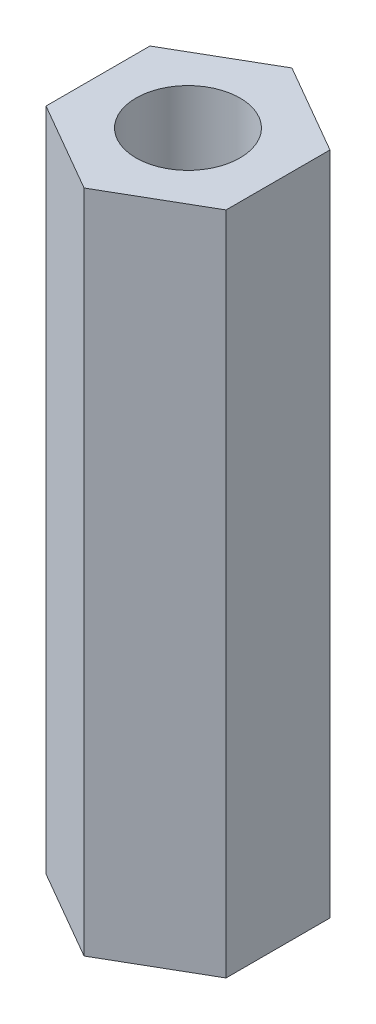
ISO-10303-21;
HEADER;
FILE_DESCRIPTION(('STEP AP214'),'2;1');
FILE_NAME('part.step','',(''),(''),'','','');
FILE_SCHEMA(('AUTOMOTIVE_DESIGN { 1 0 10303 214 1 1 1 1 }'));
ENDSEC;
DATA;
#1=APPLICATION_CONTEXT('core data for automotive mechanical design processes');
#2=APPLICATION_PROTOCOL_DEFINITION('international standard','automotive_design',2000,#1);
#3=PRODUCT_CONTEXT('',#1,'mechanical');
#4=PRODUCT('Part','Part','',(#3));
#5=PRODUCT_RELATED_PRODUCT_CATEGORY('part','',(#4));
#6=PRODUCT_DEFINITION_FORMATION('','',#4);
#7=PRODUCT_DEFINITION_CONTEXT('part definition',#1,'design');
#8=PRODUCT_DEFINITION('design','',#6,#7);
#9=PRODUCT_DEFINITION_SHAPE('','',#8);
#10=(LENGTH_UNIT() NAMED_UNIT(*) SI_UNIT(.MILLI.,.METRE.));
#11=(NAMED_UNIT(*) PLANE_ANGLE_UNIT() SI_UNIT($,.RADIAN.));
#12=(NAMED_UNIT(*) SI_UNIT($,.STERADIAN.) SOLID_ANGLE_UNIT());
#13=UNCERTAINTY_MEASURE_WITH_UNIT(LENGTH_MEASURE(1.E-05),#10,'distance_accuracy_value','');
#14=(GEOMETRIC_REPRESENTATION_CONTEXT(3) GLOBAL_UNCERTAINTY_ASSIGNED_CONTEXT((#13)) GLOBAL_UNIT_ASSIGNED_CONTEXT((#10,
#11,#12)) REPRESENTATION_CONTEXT('',''));
#15=CARTESIAN_POINT('',(0.,0.,0.));
#16=DIRECTION('',(0.,0.,1.));
#17=DIRECTION('',(1.,0.,0.));
#18=AXIS2_PLACEMENT_3D('',#15,#16,#17);
#19=CARTESIAN_POINT('',(0.,32.,-5.));
#20=DIRECTION('',(0.,1.,0.));
#21=DIRECTION('',(0.,0.,1.));
#22=AXIS2_PLACEMENT_3D('',#19,#20,#21);
#23=PLANE('',#22);
#24=DIRECTION('',(-0.866025403784439,0.,-0.5));
#25=VECTOR('',#24,1.);
#26=CARTESIAN_POINT('',(4.33012701892219,32.,-2.5));
#27=LINE('',#26,#25);
#28=CARTESIAN_POINT('',(4.33012701892219,32.,-2.5));
#29=VERTEX_POINT('',#28);
#30=CARTESIAN_POINT('',(0.,32.,-5.));
#31=VERTEX_POINT('',#30);
#32=EDGE_CURVE('E126',#29,#31,#27,.T.);
#33=ORIENTED_EDGE('',*,*,#32,.T.);
#34=DIRECTION('',(-0.866025403784439,0.,0.5));
#35=VECTOR('',#34,1.);
#36=CARTESIAN_POINT('',(0.,32.,-5.));
#37=LINE('',#36,#35);
#38=CARTESIAN_POINT('',(-4.33012701892219,32.,-2.5));
#39=VERTEX_POINT('',#38);
#40=EDGE_CURVE('E84',#31,#39,#37,.T.);
#41=ORIENTED_EDGE('',*,*,#40,.T.);
#42=DIRECTION('',(0.,0.,1.));
#43=VECTOR('',#42,1.);
#44=CARTESIAN_POINT('',(-4.33012701892219,32.,-2.5));
#45=LINE('',#44,#43);
#46=CARTESIAN_POINT('',(-4.33012701892219,32.,2.5));
#47=VERTEX_POINT('',#46);
#48=EDGE_CURVE('E97',#39,#47,#45,.T.);
#49=ORIENTED_EDGE('',*,*,#48,.T.);
#50=DIRECTION('',(0.866025403784439,0.,0.5));
#51=VECTOR('',#50,1.);
#52=CARTESIAN_POINT('',(-4.33012701892219,32.,2.5));
#53=LINE('',#52,#51);
#54=CARTESIAN_POINT('',(0.,32.,5.));
#55=VERTEX_POINT('',#54);
#56=EDGE_CURVE('E91',#47,#55,#53,.T.);
#57=ORIENTED_EDGE('',*,*,#56,.T.);
#58=DIRECTION('',(0.866025403784439,0.,-0.5));
#59=VECTOR('',#58,1.);
#60=CARTESIAN_POINT('',(0.,32.,5.));
#61=LINE('',#60,#59);
#62=CARTESIAN_POINT('',(4.33012701892219,32.,2.5));
#63=VERTEX_POINT('',#62);
#64=EDGE_CURVE('E95',#55,#63,#61,.T.);
#65=ORIENTED_EDGE('',*,*,#64,.T.);
#66=DIRECTION('',(0.,0.,-1.));
#67=VECTOR('',#66,1.);
#68=CARTESIAN_POINT('',(4.33012701892219,32.,2.5));
#69=LINE('',#68,#67);
#70=EDGE_CURVE('E47',#63,#29,#69,.T.);
#71=ORIENTED_EDGE('',*,*,#70,.T.);
#72=EDGE_LOOP('',(#33,#41,#49,#57,#65,#71));
#73=FACE_BOUND('',#72,.T.);
#74=CARTESIAN_POINT('',(0.,32.,0.));
#75=DIRECTION('',(0.,1.,0.));
#76=DIRECTION('',(0.,0.,1.));
#77=AXIS2_PLACEMENT_3D('',#74,#75,#76);
#78=CIRCLE('',#77,2.5);
#79=CARTESIAN_POINT('',(0.,32.,2.5));
#80=VERTEX_POINT('',#79);
#81=EDGE_CURVE('E119',#80,#80,#78,.T.);
#82=ORIENTED_EDGE('',*,*,#81,.F.);
#83=EDGE_LOOP('',(#82));
#84=FACE_BOUND('',#83,.T.);
#85=ADVANCED_FACE('F30',(#73,#84),#23,.T.);
#86=CARTESIAN_POINT('',(0.,0.,-5.));
#87=DIRECTION('',(0.,1.,0.));
#88=DIRECTION('',(0.,0.,1.));
#89=AXIS2_PLACEMENT_3D('',#86,#87,#88);
#90=PLANE('',#89);
#91=DIRECTION('',(-0.866025403784439,0.,-0.5));
#92=VECTOR('',#91,1.);
#93=CARTESIAN_POINT('',(4.33012701892219,0.,-2.5));
#94=LINE('',#93,#92);
#95=CARTESIAN_POINT('',(4.33012701892219,0.,-2.5));
#96=VERTEX_POINT('',#95);
#97=CARTESIAN_POINT('',(0.,0.,-5.));
#98=VERTEX_POINT('',#97);
#99=EDGE_CURVE('E115',#96,#98,#94,.T.);
#100=ORIENTED_EDGE('',*,*,#99,.F.);
#101=DIRECTION('',(0.,0.,-1.));
#102=VECTOR('',#101,1.);
#103=CARTESIAN_POINT('',(4.33012701892219,0.,2.5));
#104=LINE('',#103,#102);
#105=CARTESIAN_POINT('',(4.33012701892219,0.,2.5));
#106=VERTEX_POINT('',#105);
#107=EDGE_CURVE('E76',#106,#96,#104,.T.);
#108=ORIENTED_EDGE('',*,*,#107,.F.);
#109=DIRECTION('',(0.866025403784439,0.,-0.5));
#110=VECTOR('',#109,1.);
#111=CARTESIAN_POINT('',(0.,0.,5.));
#112=LINE('',#111,#110);
#113=CARTESIAN_POINT('',(0.,0.,5.));
#114=VERTEX_POINT('',#113);
#115=EDGE_CURVE('E70',#114,#106,#112,.T.);
#116=ORIENTED_EDGE('',*,*,#115,.F.);
#117=DIRECTION('',(0.866025403784439,0.,0.5));
#118=VECTOR('',#117,1.);
#119=CARTESIAN_POINT('',(-4.33012701892219,0.,2.5));
#120=LINE('',#119,#118);
#121=CARTESIAN_POINT('',(-4.33012701892219,0.,2.5));
#122=VERTEX_POINT('',#121);
#123=EDGE_CURVE('E105',#122,#114,#120,.T.);
#124=ORIENTED_EDGE('',*,*,#123,.F.);
#125=DIRECTION('',(0.,0.,1.));
#126=VECTOR('',#125,1.);
#127=CARTESIAN_POINT('',(-4.33012701892219,0.,-2.5));
#128=LINE('',#127,#126);
#129=CARTESIAN_POINT('',(-4.33012701892219,0.,-2.5));
#130=VERTEX_POINT('',#129);
#131=EDGE_CURVE('E121',#130,#122,#128,.T.);
#132=ORIENTED_EDGE('',*,*,#131,.F.);
#133=DIRECTION('',(-0.866025403784439,0.,0.5));
#134=VECTOR('',#133,1.);
#135=CARTESIAN_POINT('',(0.,0.,-5.));
#136=LINE('',#135,#134);
#137=EDGE_CURVE('E118',#98,#130,#136,.T.);
#138=ORIENTED_EDGE('',*,*,#137,.F.);
#139=EDGE_LOOP('',(#100,#108,#116,#124,#132,#138));
#140=FACE_BOUND('',#139,.T.);
#141=CARTESIAN_POINT('',(0.,0.,0.));
#142=DIRECTION('',(0.,1.,0.));
#143=DIRECTION('',(0.,0.,1.));
#144=AXIS2_PLACEMENT_3D('',#141,#142,#143);
#145=CIRCLE('',#144,2.5);
#146=CARTESIAN_POINT('',(0.,0.,2.5));
#147=VERTEX_POINT('',#146);
#148=EDGE_CURVE('E219',#147,#147,#145,.T.);
#149=ORIENTED_EDGE('',*,*,#148,.T.);
#150=EDGE_LOOP('',(#149));
#151=FACE_BOUND('',#150,.T.);
#152=ADVANCED_FACE('F135',(#140,#151),#90,.F.);
#153=CARTESIAN_POINT('',(4.33012701892219,32.,-2.5));
#154=DIRECTION('',(-0.5,0.,0.866025403784439));
#155=DIRECTION('',(0.866025403784439,0.,0.5));
#156=AXIS2_PLACEMENT_3D('',#153,#154,#155);
#157=PLANE('',#156);
#158=ORIENTED_EDGE('',*,*,#99,.T.);
#159=DIRECTION('',(0.,-1.,0.));
#160=VECTOR('',#159,1.);
#161=CARTESIAN_POINT('',(0.,32.,-5.));
#162=LINE('',#161,#160);
#163=EDGE_CURVE('E11',#31,#98,#162,.T.);
#164=ORIENTED_EDGE('',*,*,#163,.F.);
#165=ORIENTED_EDGE('',*,*,#32,.F.);
#166=DIRECTION('',(0.,-1.,0.));
#167=VECTOR('',#166,1.);
#168=CARTESIAN_POINT('',(4.33012701892219,32.,-2.5));
#169=LINE('',#168,#167);
#170=EDGE_CURVE('E111',#29,#96,#169,.T.);
#171=ORIENTED_EDGE('',*,*,#170,.T.);
#172=EDGE_LOOP('',(#158,#164,#165,#171));
#173=FACE_BOUND('',#172,.T.);
#174=ADVANCED_FACE('F32',(#173),#157,.F.);
#175=CARTESIAN_POINT('',(0.,32.,-5.));
#176=DIRECTION('',(0.5,0.,0.866025403784439));
#177=DIRECTION('',(0.866025403784439,0.,-0.5));
#178=AXIS2_PLACEMENT_3D('',#175,#176,#177);
#179=PLANE('',#178);
#180=ORIENTED_EDGE('',*,*,#137,.T.);
#181=DIRECTION('',(0.,-1.,0.));
#182=VECTOR('',#181,1.);
#183=CARTESIAN_POINT('',(-4.33012701892219,32.,-2.5));
#184=LINE('',#183,#182);
#185=EDGE_CURVE('E39',#39,#130,#184,.T.);
#186=ORIENTED_EDGE('',*,*,#185,.F.);
#187=ORIENTED_EDGE('',*,*,#40,.F.);
#188=ORIENTED_EDGE('',*,*,#163,.T.);
#189=EDGE_LOOP('',(#180,#186,#187,#188));
#190=FACE_BOUND('',#189,.T.);
#191=ADVANCED_FACE('F160',(#190),#179,.F.);
#192=CARTESIAN_POINT('',(-4.33012701892219,32.,-2.5));
#193=DIRECTION('',(1.,0.,0.));
#194=DIRECTION('',(0.,0.,-1.));
#195=AXIS2_PLACEMENT_3D('',#192,#193,#194);
#196=PLANE('',#195);
#197=ORIENTED_EDGE('',*,*,#131,.T.);
#198=DIRECTION('',(0.,-1.,0.));
#199=VECTOR('',#198,1.);
#200=CARTESIAN_POINT('',(-4.33012701892219,32.,2.5));
#201=LINE('',#200,#199);
#202=EDGE_CURVE('E106',#47,#122,#201,.T.);
#203=ORIENTED_EDGE('',*,*,#202,.F.);
#204=ORIENTED_EDGE('',*,*,#48,.F.);
#205=ORIENTED_EDGE('',*,*,#185,.T.);
#206=EDGE_LOOP('',(#197,#203,#204,#205));
#207=FACE_BOUND('',#206,.T.);
#208=ADVANCED_FACE('F132',(#207),#196,.F.);
#209=CARTESIAN_POINT('',(-4.33012701892219,32.,2.5));
#210=DIRECTION('',(0.5,0.,-0.866025403784439));
#211=DIRECTION('',(-0.866025403784439,0.,-0.5));
#212=AXIS2_PLACEMENT_3D('',#209,#210,#211);
#213=PLANE('',#212);
#214=ORIENTED_EDGE('',*,*,#123,.T.);
#215=DIRECTION('',(0.,-1.,0.));
#216=VECTOR('',#215,1.);
#217=CARTESIAN_POINT('',(0.,32.,5.));
#218=LINE('',#217,#216);
#219=EDGE_CURVE('E102',#55,#114,#218,.T.);
#220=ORIENTED_EDGE('',*,*,#219,.F.);
#221=ORIENTED_EDGE('',*,*,#56,.F.);
#222=ORIENTED_EDGE('',*,*,#202,.T.);
#223=EDGE_LOOP('',(#214,#220,#221,#222));
#224=FACE_BOUND('',#223,.T.);
#225=ADVANCED_FACE('F103',(#224),#213,.F.);
#226=CARTESIAN_POINT('',(0.,32.,5.));
#227=DIRECTION('',(-0.5,0.,-0.866025403784439));
#228=DIRECTION('',(-0.866025403784439,0.,0.5));
#229=AXIS2_PLACEMENT_3D('',#226,#227,#228);
#230=PLANE('',#229);
#231=ORIENTED_EDGE('',*,*,#115,.T.);
#232=DIRECTION('',(0.,-1.,0.));
#233=VECTOR('',#232,1.);
#234=CARTESIAN_POINT('',(4.33012701892219,32.,2.5));
#235=LINE('',#234,#233);
#236=EDGE_CURVE('E107',#63,#106,#235,.T.);
#237=ORIENTED_EDGE('',*,*,#236,.F.);
#238=ORIENTED_EDGE('',*,*,#64,.F.);
#239=ORIENTED_EDGE('',*,*,#219,.T.);
#240=EDGE_LOOP('',(#231,#237,#238,#239));
#241=FACE_BOUND('',#240,.T.);
#242=ADVANCED_FACE('F109',(#241),#230,.F.);
#243=CARTESIAN_POINT('',(4.33012701892219,32.,2.5));
#244=DIRECTION('',(-1.,0.,0.));
#245=DIRECTION('',(0.,0.,1.));
#246=AXIS2_PLACEMENT_3D('',#243,#244,#245);
#247=PLANE('',#246);
#248=ORIENTED_EDGE('',*,*,#107,.T.);
#249=ORIENTED_EDGE('',*,*,#170,.F.);
#250=ORIENTED_EDGE('',*,*,#70,.F.);
#251=ORIENTED_EDGE('',*,*,#236,.T.);
#252=EDGE_LOOP('',(#248,#249,#250,#251));
#253=FACE_BOUND('',#252,.T.);
#254=ADVANCED_FACE('F140',(#253),#247,.F.);
#255=CARTESIAN_POINT('',(0.,32.,0.));
#256=DIRECTION('',(0.,-1.,0.));
#257=DIRECTION('',(0.,0.,-1.));
#258=AXIS2_PLACEMENT_3D('',#255,#256,#257);
#259=CYLINDRICAL_SURFACE('',#258,2.5);
#260=ORIENTED_EDGE('',*,*,#81,.T.);
#261=EDGE_LOOP('',(#260));
#262=FACE_BOUND('',#261,.T.);
#263=ORIENTED_EDGE('',*,*,#148,.F.);
#264=EDGE_LOOP('',(#263));
#265=FACE_BOUND('',#264,.T.);
#266=ADVANCED_FACE('F142',(#262,#265),#259,.F.);
#267=CLOSED_SHELL('',(#85,#152,#174,#191,#208,#225,#242,#254,#266));
#268=MANIFOLD_SOLID_BREP('B2',#267);
#269=ADVANCED_BREP_SHAPE_REPRESENTATION('',(#18,#268),#14);
#270=SHAPE_DEFINITION_REPRESENTATION(#9,#269);
ENDSEC;
END-ISO-10303-21;
